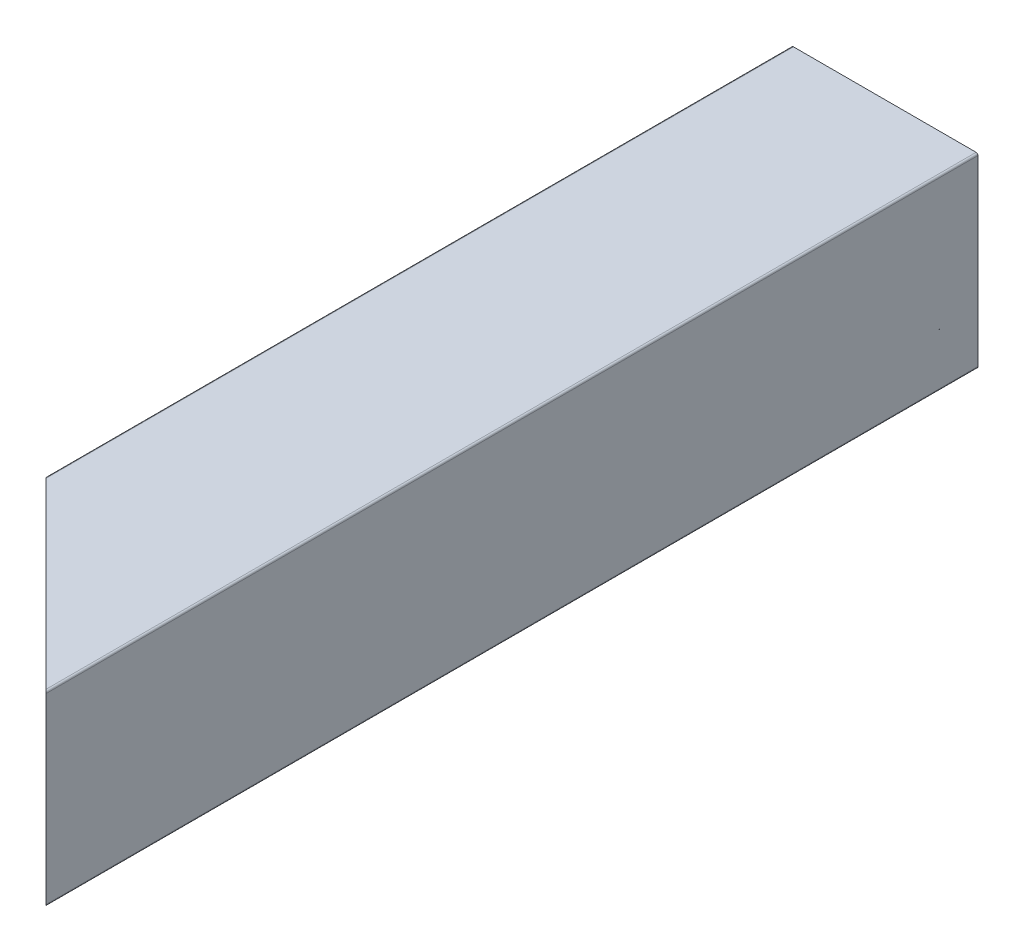
ISO-10303-21;
HEADER;
FILE_DESCRIPTION(('STEP AP214'),'2;1');
FILE_NAME('part.step','',(''),(''),'','','');
FILE_SCHEMA(('AUTOMOTIVE_DESIGN { 1 0 10303 214 1 1 1 1 }'));
ENDSEC;
DATA;
#1=APPLICATION_CONTEXT('core data for automotive mechanical design processes');
#2=APPLICATION_PROTOCOL_DEFINITION('international standard','automotive_design',2000,#1);
#3=PRODUCT_CONTEXT('',#1,'mechanical');
#4=PRODUCT('Part','Part','',(#3));
#5=PRODUCT_RELATED_PRODUCT_CATEGORY('part','',(#4));
#6=PRODUCT_DEFINITION_FORMATION('','',#4);
#7=PRODUCT_DEFINITION_CONTEXT('part definition',#1,'design');
#8=PRODUCT_DEFINITION('design','',#6,#7);
#9=PRODUCT_DEFINITION_SHAPE('','',#8);
#10=(LENGTH_UNIT() NAMED_UNIT(*) SI_UNIT(.MILLI.,.METRE.));
#11=(NAMED_UNIT(*) PLANE_ANGLE_UNIT() SI_UNIT($,.RADIAN.));
#12=(NAMED_UNIT(*) SI_UNIT($,.STERADIAN.) SOLID_ANGLE_UNIT());
#13=UNCERTAINTY_MEASURE_WITH_UNIT(LENGTH_MEASURE(1.E-05),#10,'distance_accuracy_value','');
#14=(GEOMETRIC_REPRESENTATION_CONTEXT(3) GLOBAL_UNCERTAINTY_ASSIGNED_CONTEXT((#13)) GLOBAL_UNIT_ASSIGNED_CONTEXT((#10,
#11,#12)) REPRESENTATION_CONTEXT('',''));
#15=CARTESIAN_POINT('',(0.,0.,0.));
#16=DIRECTION('',(0.,0.,1.));
#17=DIRECTION('',(1.,0.,0.));
#18=AXIS2_PLACEMENT_3D('',#15,#16,#17);
#19=CARTESIAN_POINT('',(3.175,4.7625,1828.8));
#20=DIRECTION('',(1.,0.,0.));
#21=DIRECTION('',(0.,1.,0.));
#22=AXIS2_PLACEMENT_3D('',#19,#20,#21);
#23=PLANE('',#22);
#24=DIRECTION('',(0.,1.,0.));
#25=VECTOR('',#24,1.);
#26=CARTESIAN_POINT('',(3.175,4.7625,1806.575));
#27=LINE('',#26,#25);
#28=CARTESIAN_POINT('',(3.175,4.7625,1806.575));
#29=VERTEX_POINT('',#28);
#30=CARTESIAN_POINT('',(3.175,20.6375,1806.575));
#31=VERTEX_POINT('',#30);
#32=EDGE_CURVE('E277',#29,#31,#27,.T.);
#33=ORIENTED_EDGE('',*,*,#32,.F.);
#34=DIRECTION('',(0.,0.,-1.));
#35=VECTOR('',#34,1.);
#36=CARTESIAN_POINT('',(3.175,4.7625,1828.8));
#37=LINE('',#36,#35);
#38=CARTESIAN_POINT('',(3.175,4.7625,1701.8));
#39=VERTEX_POINT('',#38);
#40=EDGE_CURVE('E65',#29,#39,#37,.T.);
#41=ORIENTED_EDGE('',*,*,#40,.T.);
#42=DIRECTION('',(0.,-1.,0.));
#43=VECTOR('',#42,1.);
#44=CARTESIAN_POINT('',(3.175,4.7625,1701.8));
#45=LINE('',#44,#43);
#46=CARTESIAN_POINT('',(3.175,20.6375,1701.8));
#47=VERTEX_POINT('',#46);
#48=EDGE_CURVE('E197',#47,#39,#45,.T.);
#49=ORIENTED_EDGE('',*,*,#48,.F.);
#50=DIRECTION('',(0.,0.,-1.));
#51=VECTOR('',#50,1.);
#52=CARTESIAN_POINT('',(3.175,20.6375,1828.8));
#53=LINE('',#52,#51);
#54=EDGE_CURVE('E50',#31,#47,#53,.T.);
#55=ORIENTED_EDGE('',*,*,#54,.F.);
#56=EDGE_LOOP('',(#33,#41,#49,#55));
#57=FACE_BOUND('',#56,.T.);
#58=ADVANCED_FACE('F42',(#57),#23,.T.);
#59=CARTESIAN_POINT('',(4.7625,20.6375,1828.8));
#60=DIRECTION('',(0.,0.,-1.));
#61=DIRECTION('',(-1.,0.,0.));
#62=AXIS2_PLACEMENT_3D('',#59,#60,#61);
#63=CYLINDRICAL_SURFACE('',#62,1.5875);
#64=DIRECTION('',(0.,0.,-1.));
#65=VECTOR('',#64,1.);
#66=CARTESIAN_POINT('',(4.7625,22.225,1828.8));
#67=LINE('',#66,#65);
#68=CARTESIAN_POINT('',(4.7625,22.225,1808.1625));
#69=VERTEX_POINT('',#68);
#70=CARTESIAN_POINT('',(4.7625,22.225,1701.8));
#71=VERTEX_POINT('',#70);
#72=EDGE_CURVE('E220',#69,#71,#67,.T.);
#73=ORIENTED_EDGE('',*,*,#72,.F.);
#74=CARTESIAN_POINT('',(4.7625,20.6375,1808.1625));
#75=DIRECTION('',(0.707106781186551,0.,-0.707106781186544));
#76=DIRECTION('',(-0.707106781186544,0.,-0.707106781186551));
#77=AXIS2_PLACEMENT_3D('',#74,#75,#76);
#78=ELLIPSE('',#77,2.2450640302673,1.5875);
#79=EDGE_CURVE('E279',#69,#31,#78,.F.);
#80=ORIENTED_EDGE('',*,*,#79,.T.);
#81=ORIENTED_EDGE('',*,*,#54,.T.);
#82=CARTESIAN_POINT('',(4.7625,20.6375,1701.8));
#83=DIRECTION('',(0.,0.,1.));
#84=DIRECTION('',(1.,0.,0.));
#85=AXIS2_PLACEMENT_3D('',#82,#83,#84);
#86=CIRCLE('',#85,1.5875);
#87=EDGE_CURVE('E201',#47,#71,#86,.F.);
#88=ORIENTED_EDGE('',*,*,#87,.T.);
#89=EDGE_LOOP('',(#73,#80,#81,#88));
#90=FACE_BOUND('',#89,.T.);
#91=ADVANCED_FACE('F336',(#90),#63,.F.);
#92=CARTESIAN_POINT('',(4.7625,22.225,1828.8));
#93=DIRECTION('',(0.,-1.,0.));
#94=DIRECTION('',(0.,0.,-1.));
#95=AXIS2_PLACEMENT_3D('',#92,#93,#94);
#96=PLANE('',#95);
#97=DIRECTION('',(0.707106781186544,0.,0.707106781186551));
#98=VECTOR('',#97,1.);
#99=CARTESIAN_POINT('',(15.0812500000001,22.225,1818.48125));
#100=LINE('',#99,#98);
#101=CARTESIAN_POINT('',(20.6375,22.225,1824.0375));
#102=VERTEX_POINT('',#101);
#103=EDGE_CURVE('E282',#69,#102,#100,.T.);
#104=ORIENTED_EDGE('',*,*,#103,.F.);
#105=ORIENTED_EDGE('',*,*,#72,.T.);
#106=DIRECTION('',(-1.,0.,0.));
#107=VECTOR('',#106,1.);
#108=CARTESIAN_POINT('',(4.7625,22.225,1701.8));
#109=LINE('',#108,#107);
#110=CARTESIAN_POINT('',(20.6375,22.225,1701.8));
#111=VERTEX_POINT('',#110);
#112=EDGE_CURVE('E208',#111,#71,#109,.T.);
#113=ORIENTED_EDGE('',*,*,#112,.F.);
#114=DIRECTION('',(0.,0.,-1.));
#115=VECTOR('',#114,1.);
#116=CARTESIAN_POINT('',(20.6375,22.225,1828.8));
#117=LINE('',#116,#115);
#118=EDGE_CURVE('E218',#102,#111,#117,.T.);
#119=ORIENTED_EDGE('',*,*,#118,.F.);
#120=EDGE_LOOP('',(#104,#105,#113,#119));
#121=FACE_BOUND('',#120,.T.);
#122=ADVANCED_FACE('F341',(#121),#96,.T.);
#123=CARTESIAN_POINT('',(20.6375,20.6375,1828.8));
#124=DIRECTION('',(0.,0.,-1.));
#125=DIRECTION('',(-1.,0.,0.));
#126=AXIS2_PLACEMENT_3D('',#123,#124,#125);
#127=CYLINDRICAL_SURFACE('',#126,1.5875);
#128=DIRECTION('',(0.,0.,-1.));
#129=VECTOR('',#128,1.);
#130=CARTESIAN_POINT('',(22.225,20.6375,1828.8));
#131=LINE('',#130,#129);
#132=CARTESIAN_POINT('',(22.225,20.6375,1825.625));
#133=VERTEX_POINT('',#132);
#134=CARTESIAN_POINT('',(22.225,20.6375,1701.8));
#135=VERTEX_POINT('',#134);
#136=EDGE_CURVE('E221',#133,#135,#131,.T.);
#137=ORIENTED_EDGE('',*,*,#136,.F.);
#138=CARTESIAN_POINT('',(20.6375,20.6375,1824.0375));
#139=DIRECTION('',(0.707106781186551,0.,-0.707106781186544));
#140=DIRECTION('',(-0.707106781186544,0.,-0.707106781186551));
#141=AXIS2_PLACEMENT_3D('',#138,#139,#140);
#142=ELLIPSE('',#141,2.2450640302673,1.5875);
#143=EDGE_CURVE('E284',#133,#102,#142,.F.);
#144=ORIENTED_EDGE('',*,*,#143,.T.);
#145=ORIENTED_EDGE('',*,*,#118,.T.);
#146=CARTESIAN_POINT('',(20.6375,20.6375,1701.8));
#147=DIRECTION('',(0.,0.,1.));
#148=DIRECTION('',(1.,0.,0.));
#149=AXIS2_PLACEMENT_3D('',#146,#147,#148);
#150=CIRCLE('',#149,1.5875);
#151=EDGE_CURVE('E244',#111,#135,#150,.F.);
#152=ORIENTED_EDGE('',*,*,#151,.T.);
#153=EDGE_LOOP('',(#137,#144,#145,#152));
#154=FACE_BOUND('',#153,.T.);
#155=ADVANCED_FACE('F250',(#154),#127,.F.);
#156=CARTESIAN_POINT('',(22.225,4.7625,1828.8));
#157=DIRECTION('',(-1.,0.,0.));
#158=DIRECTION('',(0.,0.,1.));
#159=AXIS2_PLACEMENT_3D('',#156,#157,#158);
#160=PLANE('',#159);
#161=DIRECTION('',(0.,-1.,0.));
#162=VECTOR('',#161,1.);
#163=CARTESIAN_POINT('',(22.225,4.7625,1825.625));
#164=LINE('',#163,#162);
#165=CARTESIAN_POINT('',(22.225,4.7625,1825.625));
#166=VERTEX_POINT('',#165);
#167=EDGE_CURVE('E235',#133,#166,#164,.T.);
#168=ORIENTED_EDGE('',*,*,#167,.F.);
#169=ORIENTED_EDGE('',*,*,#136,.T.);
#170=DIRECTION('',(0.,1.,0.));
#171=VECTOR('',#170,1.);
#172=CARTESIAN_POINT('',(22.225,4.7625,1701.8));
#173=LINE('',#172,#171);
#174=CARTESIAN_POINT('',(22.225,4.7625,1701.8));
#175=VERTEX_POINT('',#174);
#176=EDGE_CURVE('E234',#175,#135,#173,.T.);
#177=ORIENTED_EDGE('',*,*,#176,.F.);
#178=DIRECTION('',(0.,0.,-1.));
#179=VECTOR('',#178,1.);
#180=CARTESIAN_POINT('',(22.225,4.7625,1828.8));
#181=LINE('',#180,#179);
#182=EDGE_CURVE('E194',#166,#175,#181,.T.);
#183=ORIENTED_EDGE('',*,*,#182,.F.);
#184=EDGE_LOOP('',(#168,#169,#177,#183));
#185=FACE_BOUND('',#184,.T.);
#186=ADVANCED_FACE('F232',(#185),#160,.T.);
#187=CARTESIAN_POINT('',(20.6375,4.7625,1828.8));
#188=DIRECTION('',(0.,0.,-1.));
#189=DIRECTION('',(-1.,0.,0.));
#190=AXIS2_PLACEMENT_3D('',#187,#188,#189);
#191=CYLINDRICAL_SURFACE('',#190,1.5875);
#192=DIRECTION('',(0.,0.,-1.));
#193=VECTOR('',#192,1.);
#194=CARTESIAN_POINT('',(20.6375,3.175,1828.8));
#195=LINE('',#194,#193);
#196=CARTESIAN_POINT('',(20.6375,3.175,1824.0375));
#197=VERTEX_POINT('',#196);
#198=CARTESIAN_POINT('',(20.6375,3.175,1701.8));
#199=VERTEX_POINT('',#198);
#200=EDGE_CURVE('E193',#197,#199,#195,.T.);
#201=ORIENTED_EDGE('',*,*,#200,.F.);
#202=CARTESIAN_POINT('',(20.6375,4.7625,1824.0375));
#203=DIRECTION('',(0.707106781186551,0.,-0.707106781186544));
#204=DIRECTION('',(-0.707106781186544,0.,-0.707106781186551));
#205=AXIS2_PLACEMENT_3D('',#202,#203,#204);
#206=ELLIPSE('',#205,2.2450640302673,1.5875);
#207=EDGE_CURVE('E287',#197,#166,#206,.F.);
#208=ORIENTED_EDGE('',*,*,#207,.T.);
#209=ORIENTED_EDGE('',*,*,#182,.T.);
#210=CARTESIAN_POINT('',(20.6375,4.7625,1701.8));
#211=DIRECTION('',(0.,0.,1.));
#212=DIRECTION('',(1.,0.,0.));
#213=AXIS2_PLACEMENT_3D('',#210,#211,#212);
#214=CIRCLE('',#213,1.5875);
#215=EDGE_CURVE('E248',#175,#199,#214,.F.);
#216=ORIENTED_EDGE('',*,*,#215,.T.);
#217=EDGE_LOOP('',(#201,#208,#209,#216));
#218=FACE_BOUND('',#217,.T.);
#219=ADVANCED_FACE('F348',(#218),#191,.F.);
#220=CARTESIAN_POINT('',(4.7625,3.175,1828.8));
#221=DIRECTION('',(0.,1.,0.));
#222=DIRECTION('',(1.,0.,0.));
#223=AXIS2_PLACEMENT_3D('',#220,#221,#222);
#224=PLANE('',#223);
#225=DIRECTION('',(-0.707106781186544,0.,-0.707106781186551));
#226=VECTOR('',#225,1.);
#227=CARTESIAN_POINT('',(15.0812500000001,3.175,1818.48125));
#228=LINE('',#227,#226);
#229=CARTESIAN_POINT('',(4.7625,3.175,1808.1625));
#230=VERTEX_POINT('',#229);
#231=EDGE_CURVE('E57',#197,#230,#228,.T.);
#232=ORIENTED_EDGE('',*,*,#231,.F.);
#233=ORIENTED_EDGE('',*,*,#200,.T.);
#234=DIRECTION('',(1.,0.,0.));
#235=VECTOR('',#234,1.);
#236=CARTESIAN_POINT('',(4.7625,3.175,1701.8));
#237=LINE('',#236,#235);
#238=CARTESIAN_POINT('',(4.7625,3.175,1701.8));
#239=VERTEX_POINT('',#238);
#240=EDGE_CURVE('E255',#239,#199,#237,.T.);
#241=ORIENTED_EDGE('',*,*,#240,.F.);
#242=DIRECTION('',(0.,0.,-1.));
#243=VECTOR('',#242,1.);
#244=CARTESIAN_POINT('',(4.7625,3.175,1828.8));
#245=LINE('',#244,#243);
#246=EDGE_CURVE('E195',#230,#239,#245,.T.);
#247=ORIENTED_EDGE('',*,*,#246,.F.);
#248=EDGE_LOOP('',(#232,#233,#241,#247));
#249=FACE_BOUND('',#248,.T.);
#250=ADVANCED_FACE('F350',(#249),#224,.T.);
#251=CARTESIAN_POINT('',(4.7625,4.7625,1828.8));
#252=DIRECTION('',(0.,0.,-1.));
#253=DIRECTION('',(-1.,0.,0.));
#254=AXIS2_PLACEMENT_3D('',#251,#252,#253);
#255=CYLINDRICAL_SURFACE('',#254,1.5875);
#256=ORIENTED_EDGE('',*,*,#40,.F.);
#257=CARTESIAN_POINT('',(4.7625,4.7625,1808.1625));
#258=DIRECTION('',(0.707106781186551,0.,-0.707106781186544));
#259=DIRECTION('',(-0.707106781186544,0.,-0.707106781186551));
#260=AXIS2_PLACEMENT_3D('',#257,#258,#259);
#261=ELLIPSE('',#260,2.2450640302673,1.5875);
#262=EDGE_CURVE('E168',#29,#230,#261,.F.);
#263=ORIENTED_EDGE('',*,*,#262,.T.);
#264=ORIENTED_EDGE('',*,*,#246,.T.);
#265=CARTESIAN_POINT('',(4.7625,4.7625,1701.8));
#266=DIRECTION('',(0.,0.,1.));
#267=DIRECTION('',(1.,0.,0.));
#268=AXIS2_PLACEMENT_3D('',#265,#266,#267);
#269=CIRCLE('',#268,1.5875);
#270=EDGE_CURVE('E257',#239,#39,#269,.F.);
#271=ORIENTED_EDGE('',*,*,#270,.T.);
#272=EDGE_LOOP('',(#256,#263,#264,#271));
#273=FACE_BOUND('',#272,.T.);
#274=ADVANCED_FACE('F356',(#273),#255,.F.);
#275=CARTESIAN_POINT('',(0.,0.254,1828.8));
#276=DIRECTION('',(1.,0.,0.));
#277=DIRECTION('',(0.,1.,0.));
#278=AXIS2_PLACEMENT_3D('',#275,#276,#277);
#279=PLANE('',#278);
#280=DIRECTION('',(0.,0.,-1.));
#281=VECTOR('',#280,1.);
#282=CARTESIAN_POINT('',(0.,0.254,1828.8));
#283=LINE('',#282,#281);
#284=CARTESIAN_POINT('',(0.,0.254,1803.4));
#285=VERTEX_POINT('',#284);
#286=CARTESIAN_POINT('',(0.,0.254,1701.8));
#287=VERTEX_POINT('',#286);
#288=EDGE_CURVE('E200',#285,#287,#283,.T.);
#289=ORIENTED_EDGE('',*,*,#288,.F.);
#290=DIRECTION('',(0.,1.,0.));
#291=VECTOR('',#290,1.);
#292=CARTESIAN_POINT('',(0.,0.254,1803.4));
#293=LINE('',#292,#291);
#294=CARTESIAN_POINT('',(0.,25.146,1803.4));
#295=VERTEX_POINT('',#294);
#296=EDGE_CURVE('E293',#285,#295,#293,.T.);
#297=ORIENTED_EDGE('',*,*,#296,.T.);
#298=DIRECTION('',(0.,0.,-1.));
#299=VECTOR('',#298,1.);
#300=CARTESIAN_POINT('',(0.,25.146,1828.8));
#301=LINE('',#300,#299);
#302=CARTESIAN_POINT('',(0.,25.146,1701.8));
#303=VERTEX_POINT('',#302);
#304=EDGE_CURVE('E184',#295,#303,#301,.T.);
#305=ORIENTED_EDGE('',*,*,#304,.T.);
#306=DIRECTION('',(0.,-1.,0.));
#307=VECTOR('',#306,1.);
#308=CARTESIAN_POINT('',(0.,0.254,1701.8));
#309=LINE('',#308,#307);
#310=EDGE_CURVE('E269',#303,#287,#309,.T.);
#311=ORIENTED_EDGE('',*,*,#310,.T.);
#312=EDGE_LOOP('',(#289,#297,#305,#311));
#313=FACE_BOUND('',#312,.T.);
#314=ADVANCED_FACE('F315',(#313),#279,.F.);
#315=CARTESIAN_POINT('',(0.254,25.146,1828.8));
#316=DIRECTION('',(0.,0.,-1.));
#317=DIRECTION('',(-1.,0.,0.));
#318=AXIS2_PLACEMENT_3D('',#315,#316,#317);
#319=CYLINDRICAL_SURFACE('',#318,0.254);
#320=CARTESIAN_POINT('',(0.254,25.146,1803.654));
#321=DIRECTION('',(0.707106781186551,0.,-0.707106781186544));
#322=DIRECTION('',(-0.707106781186544,0.,-0.707106781186551));
#323=AXIS2_PLACEMENT_3D('',#320,#321,#322);
#324=ELLIPSE('',#323,0.359210244842768,0.254);
#325=CARTESIAN_POINT('',(0.253999999999997,25.4,1803.654));
#326=VERTEX_POINT('',#325);
#327=EDGE_CURVE('E169',#326,#295,#324,.F.);
#328=ORIENTED_EDGE('',*,*,#327,.F.);
#329=DIRECTION('',(0.,0.,-1.));
#330=VECTOR('',#329,1.);
#331=CARTESIAN_POINT('',(0.254,25.4,1828.8));
#332=LINE('',#331,#330);
#333=CARTESIAN_POINT('',(0.254000000000004,25.4,1701.8));
#334=VERTEX_POINT('',#333);
#335=EDGE_CURVE('E177',#326,#334,#332,.T.);
#336=ORIENTED_EDGE('',*,*,#335,.T.);
#337=CARTESIAN_POINT('',(0.254,25.146,1701.8));
#338=DIRECTION('',(0.,0.,1.));
#339=DIRECTION('',(1.,0.,0.));
#340=AXIS2_PLACEMENT_3D('',#337,#338,#339);
#341=CIRCLE('',#340,0.254);
#342=EDGE_CURVE('E266',#303,#334,#341,.F.);
#343=ORIENTED_EDGE('',*,*,#342,.F.);
#344=ORIENTED_EDGE('',*,*,#304,.F.);
#345=EDGE_LOOP('',(#328,#336,#343,#344));
#346=FACE_BOUND('',#345,.T.);
#347=ADVANCED_FACE('F318',(#346),#319,.T.);
#348=CARTESIAN_POINT('',(0.254,25.4,1828.8));
#349=DIRECTION('',(0.,-1.,0.));
#350=DIRECTION('',(0.,0.,-1.));
#351=AXIS2_PLACEMENT_3D('',#348,#349,#350);
#352=PLANE('',#351);
#353=ORIENTED_EDGE('',*,*,#335,.F.);
#354=DIRECTION('',(-0.707106781186544,0.,-0.707106781186551));
#355=VECTOR('',#354,1.);
#356=CARTESIAN_POINT('',(-15.7518674443784,25.4,1787.64813255562));
#357=LINE('',#356,#355);
#358=CARTESIAN_POINT('',(25.146,25.4,1828.546));
#359=VERTEX_POINT('',#358);
#360=EDGE_CURVE('E160',#359,#326,#357,.T.);
#361=ORIENTED_EDGE('',*,*,#360,.F.);
#362=DIRECTION('',(0.,0.,-1.));
#363=VECTOR('',#362,1.);
#364=CARTESIAN_POINT('',(25.146,25.4,1828.8));
#365=LINE('',#364,#363);
#366=CARTESIAN_POINT('',(25.146,25.4,1701.8));
#367=VERTEX_POINT('',#366);
#368=EDGE_CURVE('E175',#359,#367,#365,.T.);
#369=ORIENTED_EDGE('',*,*,#368,.T.);
#370=DIRECTION('',(1.,0.,0.));
#371=VECTOR('',#370,1.);
#372=CARTESIAN_POINT('',(-135.222379220066,25.4,1701.8));
#373=LINE('',#372,#371);
#374=EDGE_CURVE('E275',#334,#367,#373,.T.);
#375=ORIENTED_EDGE('',*,*,#374,.F.);
#376=EDGE_LOOP('',(#353,#361,#369,#375));
#377=FACE_BOUND('',#376,.T.);
#378=ADVANCED_FACE('F173',(#377),#352,.F.);
#379=CARTESIAN_POINT('',(25.146,25.146,1828.8));
#380=DIRECTION('',(0.,0.,-1.));
#381=DIRECTION('',(-1.,0.,0.));
#382=AXIS2_PLACEMENT_3D('',#379,#380,#381);
#383=CYLINDRICAL_SURFACE('',#382,0.254);
#384=CARTESIAN_POINT('',(25.146,25.146,1828.546));
#385=DIRECTION('',(0.707106781186551,0.,-0.707106781186544));
#386=DIRECTION('',(-0.707106781186544,0.,-0.707106781186551));
#387=AXIS2_PLACEMENT_3D('',#384,#385,#386);
#388=ELLIPSE('',#387,0.359210244842768,0.254);
#389=CARTESIAN_POINT('',(25.4000000000001,25.146,1828.8));
#390=VERTEX_POINT('',#389);
#391=EDGE_CURVE('E157',#390,#359,#388,.F.);
#392=ORIENTED_EDGE('',*,*,#391,.F.);
#393=DIRECTION('',(0.,0.,-1.));
#394=VECTOR('',#393,1.);
#395=CARTESIAN_POINT('',(25.4,25.146,1828.8));
#396=LINE('',#395,#394);
#397=CARTESIAN_POINT('',(25.4,25.146,1701.8));
#398=VERTEX_POINT('',#397);
#399=EDGE_CURVE('E182',#390,#398,#396,.T.);
#400=ORIENTED_EDGE('',*,*,#399,.T.);
#401=CARTESIAN_POINT('',(25.146,25.146,1701.8));
#402=DIRECTION('',(0.,0.,1.));
#403=DIRECTION('',(1.,0.,0.));
#404=AXIS2_PLACEMENT_3D('',#401,#402,#403);
#405=CIRCLE('',#404,0.254);
#406=EDGE_CURVE('E181',#367,#398,#405,.F.);
#407=ORIENTED_EDGE('',*,*,#406,.F.);
#408=ORIENTED_EDGE('',*,*,#368,.F.);
#409=EDGE_LOOP('',(#392,#400,#407,#408));
#410=FACE_BOUND('',#409,.T.);
#411=ADVANCED_FACE('F44',(#410),#383,.T.);
#412=CARTESIAN_POINT('',(25.4,0.254,1828.8));
#413=DIRECTION('',(-1.,0.,0.));
#414=DIRECTION('',(0.,0.,1.));
#415=AXIS2_PLACEMENT_3D('',#412,#413,#414);
#416=PLANE('',#415);
#417=DIRECTION('',(0.,0.,-1.));
#418=VECTOR('',#417,1.);
#419=CARTESIAN_POINT('',(25.4,0.254,1828.8));
#420=LINE('',#419,#418);
#421=CARTESIAN_POINT('',(25.4,0.254,1828.8));
#422=VERTEX_POINT('',#421);
#423=CARTESIAN_POINT('',(25.4,0.254,1701.8));
#424=VERTEX_POINT('',#423);
#425=EDGE_CURVE('E187',#422,#424,#420,.T.);
#426=ORIENTED_EDGE('',*,*,#425,.T.);
#427=DIRECTION('',(0.,1.,0.));
#428=VECTOR('',#427,1.);
#429=CARTESIAN_POINT('',(25.4,0.254,1701.8));
#430=LINE('',#429,#428);
#431=EDGE_CURVE('E260',#424,#398,#430,.T.);
#432=ORIENTED_EDGE('',*,*,#431,.T.);
#433=ORIENTED_EDGE('',*,*,#399,.F.);
#434=DIRECTION('',(0.,1.,0.));
#435=VECTOR('',#434,1.);
#436=CARTESIAN_POINT('',(25.4,0.254,1828.8));
#437=LINE('',#436,#435);
#438=EDGE_CURVE('E163',#422,#390,#437,.T.);
#439=ORIENTED_EDGE('',*,*,#438,.F.);
#440=EDGE_LOOP('',(#426,#432,#433,#439));
#441=FACE_BOUND('',#440,.T.);
#442=ADVANCED_FACE('F321',(#441),#416,.F.);
#443=CARTESIAN_POINT('',(25.146,0.254,1828.8));
#444=DIRECTION('',(0.,0.,-1.));
#445=DIRECTION('',(-1.,0.,0.));
#446=AXIS2_PLACEMENT_3D('',#443,#444,#445);
#447=CYLINDRICAL_SURFACE('',#446,0.254);
#448=CARTESIAN_POINT('',(25.146,0.254,1828.546));
#449=DIRECTION('',(0.707106781186551,0.,-0.707106781186544));
#450=DIRECTION('',(-0.707106781186544,0.,-0.707106781186551));
#451=AXIS2_PLACEMENT_3D('',#448,#449,#450);
#452=ELLIPSE('',#451,0.359210244842768,0.254);
#453=CARTESIAN_POINT('',(25.1460000000001,0.,1828.546));
#454=VERTEX_POINT('',#453);
#455=EDGE_CURVE('E298',#454,#422,#452,.F.);
#456=ORIENTED_EDGE('',*,*,#455,.F.);
#457=DIRECTION('',(0.,0.,-1.));
#458=VECTOR('',#457,1.);
#459=CARTESIAN_POINT('',(25.146,0.,1828.8));
#460=LINE('',#459,#458);
#461=CARTESIAN_POINT('',(25.146,0.,1701.8));
#462=VERTEX_POINT('',#461);
#463=EDGE_CURVE('E213',#454,#462,#460,.T.);
#464=ORIENTED_EDGE('',*,*,#463,.T.);
#465=CARTESIAN_POINT('',(25.146,0.254,1701.8));
#466=DIRECTION('',(0.,0.,1.));
#467=DIRECTION('',(1.,0.,0.));
#468=AXIS2_PLACEMENT_3D('',#465,#466,#467);
#469=CIRCLE('',#468,0.254);
#470=EDGE_CURVE('E263',#424,#462,#469,.F.);
#471=ORIENTED_EDGE('',*,*,#470,.F.);
#472=ORIENTED_EDGE('',*,*,#425,.F.);
#473=EDGE_LOOP('',(#456,#464,#471,#472));
#474=FACE_BOUND('',#473,.T.);
#475=ADVANCED_FACE('F324',(#474),#447,.T.);
#476=CARTESIAN_POINT('',(0.254,0.,1828.8));
#477=DIRECTION('',(0.,1.,0.));
#478=DIRECTION('',(1.,0.,0.));
#479=AXIS2_PLACEMENT_3D('',#476,#477,#478);
#480=PLANE('',#479);
#481=ORIENTED_EDGE('',*,*,#463,.F.);
#482=DIRECTION('',(-0.707106781186544,0.,-0.707106781186551));
#483=VECTOR('',#482,1.);
#484=CARTESIAN_POINT('',(-15.7518674443784,0.,1787.64813255562));
#485=LINE('',#484,#483);
#486=CARTESIAN_POINT('',(0.253999999999999,0.,1803.654));
#487=VERTEX_POINT('',#486);
#488=EDGE_CURVE('E178',#454,#487,#485,.T.);
#489=ORIENTED_EDGE('',*,*,#488,.T.);
#490=DIRECTION('',(0.,0.,-1.));
#491=VECTOR('',#490,1.);
#492=CARTESIAN_POINT('',(0.254,0.,1828.8));
#493=LINE('',#492,#491);
#494=CARTESIAN_POINT('',(0.254,0.,1701.8));
#495=VERTEX_POINT('',#494);
#496=EDGE_CURVE('E190',#487,#495,#493,.T.);
#497=ORIENTED_EDGE('',*,*,#496,.T.);
#498=DIRECTION('',(-1.,0.,0.));
#499=VECTOR('',#498,1.);
#500=CARTESIAN_POINT('',(-135.222379220066,0.,1701.8));
#501=LINE('',#500,#499);
#502=EDGE_CURVE('E272',#462,#495,#501,.T.);
#503=ORIENTED_EDGE('',*,*,#502,.F.);
#504=EDGE_LOOP('',(#481,#489,#497,#503));
#505=FACE_BOUND('',#504,.T.);
#506=ADVANCED_FACE('F304',(#505),#480,.F.);
#507=CARTESIAN_POINT('',(0.254,0.254,1828.8));
#508=DIRECTION('',(0.,0.,-1.));
#509=DIRECTION('',(-1.,0.,0.));
#510=AXIS2_PLACEMENT_3D('',#507,#508,#509);
#511=CYLINDRICAL_SURFACE('',#510,0.254);
#512=CARTESIAN_POINT('',(0.254,0.254,1803.654));
#513=DIRECTION('',(0.707106781186551,0.,-0.707106781186544));
#514=DIRECTION('',(-0.707106781186544,0.,-0.707106781186551));
#515=AXIS2_PLACEMENT_3D('',#512,#513,#514);
#516=ELLIPSE('',#515,0.359210244842768,0.254);
#517=EDGE_CURVE('E296',#285,#487,#516,.F.);
#518=ORIENTED_EDGE('',*,*,#517,.F.);
#519=ORIENTED_EDGE('',*,*,#288,.T.);
#520=CARTESIAN_POINT('',(0.254,0.254,1701.8));
#521=DIRECTION('',(0.,0.,1.));
#522=DIRECTION('',(1.,0.,0.));
#523=AXIS2_PLACEMENT_3D('',#520,#521,#522);
#524=CIRCLE('',#523,0.254);
#525=EDGE_CURVE('E11',#495,#287,#524,.F.);
#526=ORIENTED_EDGE('',*,*,#525,.F.);
#527=ORIENTED_EDGE('',*,*,#496,.F.);
#528=EDGE_LOOP('',(#518,#519,#526,#527));
#529=FACE_BOUND('',#528,.T.);
#530=ADVANCED_FACE('F310',(#529),#511,.T.);
#531=CARTESIAN_POINT('',(-135.222379220066,-1723.13883427537,1701.8));
#532=DIRECTION('',(0.,0.,1.));
#533=DIRECTION('',(1.,0.,0.));
#534=AXIS2_PLACEMENT_3D('',#531,#532,#533);
#535=PLANE('',#534);
#536=ORIENTED_EDGE('',*,*,#48,.T.);
#537=ORIENTED_EDGE('',*,*,#270,.F.);
#538=ORIENTED_EDGE('',*,*,#240,.T.);
#539=ORIENTED_EDGE('',*,*,#215,.F.);
#540=ORIENTED_EDGE('',*,*,#176,.T.);
#541=ORIENTED_EDGE('',*,*,#151,.F.);
#542=ORIENTED_EDGE('',*,*,#112,.T.);
#543=ORIENTED_EDGE('',*,*,#87,.F.);
#544=EDGE_LOOP('',(#536,#537,#538,#539,#540,#541,#542,#543));
#545=FACE_BOUND('',#544,.T.);
#546=ORIENTED_EDGE('',*,*,#406,.T.);
#547=ORIENTED_EDGE('',*,*,#431,.F.);
#548=ORIENTED_EDGE('',*,*,#470,.T.);
#549=ORIENTED_EDGE('',*,*,#502,.T.);
#550=ORIENTED_EDGE('',*,*,#525,.T.);
#551=ORIENTED_EDGE('',*,*,#310,.F.);
#552=ORIENTED_EDGE('',*,*,#342,.T.);
#553=ORIENTED_EDGE('',*,*,#374,.T.);
#554=EDGE_LOOP('',(#546,#547,#548,#549,#550,#551,#552,#553));
#555=FACE_BOUND('',#554,.T.);
#556=ADVANCED_FACE('F241',(#545,#555),#535,.F.);
#557=CARTESIAN_POINT('',(-15.7518674443784,0.,1787.64813255562));
#558=DIRECTION('',(0.707106781186551,0.,-0.707106781186544));
#559=DIRECTION('',(-0.707106781186544,0.,-0.707106781186551));
#560=AXIS2_PLACEMENT_3D('',#557,#558,#559);
#561=PLANE('',#560);
#562=ORIENTED_EDGE('',*,*,#32,.T.);
#563=ORIENTED_EDGE('',*,*,#79,.F.);
#564=ORIENTED_EDGE('',*,*,#103,.T.);
#565=ORIENTED_EDGE('',*,*,#143,.F.);
#566=ORIENTED_EDGE('',*,*,#167,.T.);
#567=ORIENTED_EDGE('',*,*,#207,.F.);
#568=ORIENTED_EDGE('',*,*,#231,.T.);
#569=ORIENTED_EDGE('',*,*,#262,.F.);
#570=EDGE_LOOP('',(#562,#563,#564,#565,#566,#567,#568,#569));
#571=FACE_BOUND('',#570,.T.);
#572=ORIENTED_EDGE('',*,*,#391,.T.);
#573=ORIENTED_EDGE('',*,*,#360,.T.);
#574=ORIENTED_EDGE('',*,*,#327,.T.);
#575=ORIENTED_EDGE('',*,*,#296,.F.);
#576=ORIENTED_EDGE('',*,*,#517,.T.);
#577=ORIENTED_EDGE('',*,*,#488,.F.);
#578=ORIENTED_EDGE('',*,*,#455,.T.);
#579=ORIENTED_EDGE('',*,*,#438,.T.);
#580=EDGE_LOOP('',(#572,#573,#574,#575,#576,#577,#578,#579));
#581=FACE_BOUND('',#580,.T.);
#582=ADVANCED_FACE('F159',(#571,#581),#561,.F.);
#583=CLOSED_SHELL('',(#58,#91,#122,#155,#186,#219,#250,#274,#314,#347,#378,#411,#442,#475,#506,
#530,#556,#582));
#584=MANIFOLD_SOLID_BREP('B2',#583);
#585=ADVANCED_BREP_SHAPE_REPRESENTATION('',(#18,#584),#14);
#586=SHAPE_DEFINITION_REPRESENTATION(#9,#585);
ENDSEC;
END-ISO-10303-21;
